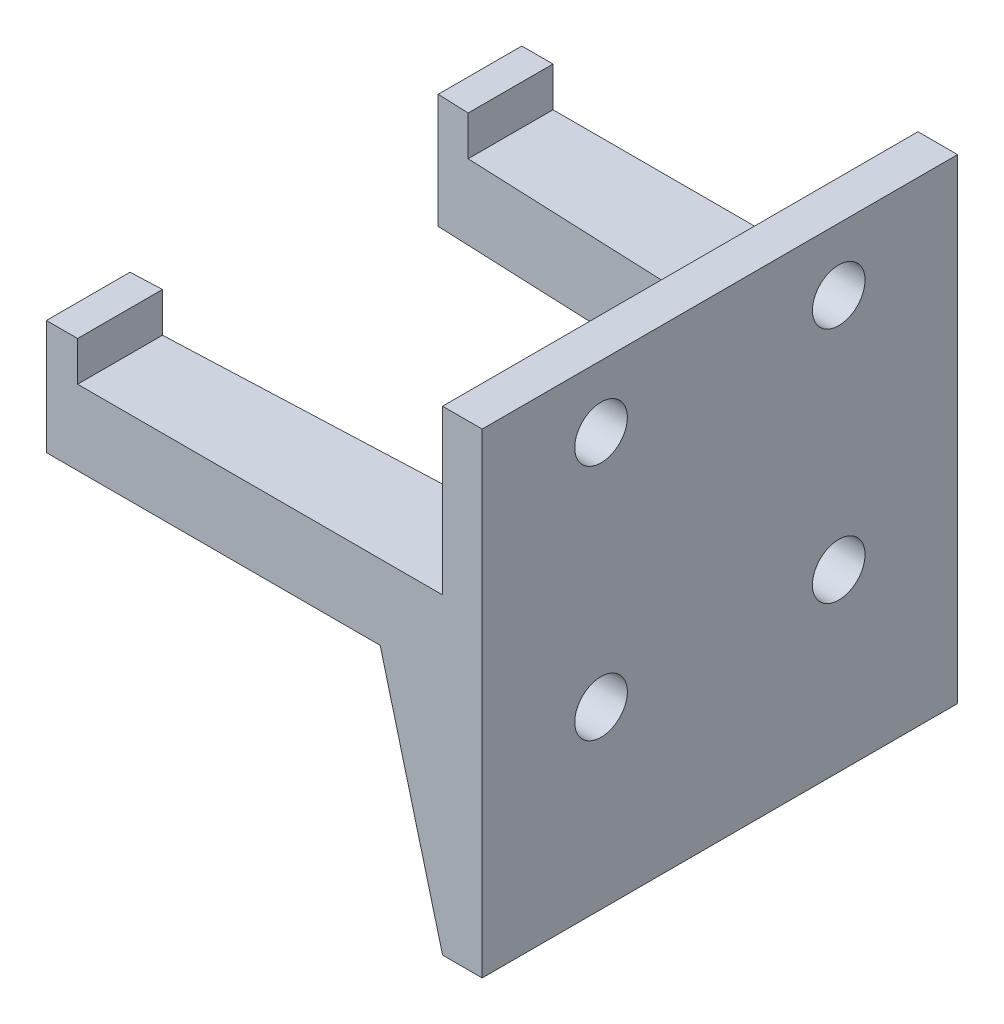
ISO-10303-21;
HEADER;
FILE_DESCRIPTION(('STEP AP214'),'2;1');
FILE_NAME('part.step','',(''),(''),'','','');
FILE_SCHEMA(('AUTOMOTIVE_DESIGN { 1 0 10303 214 1 1 1 1 }'));
ENDSEC;
DATA;
#1=APPLICATION_CONTEXT('core data for automotive mechanical design processes');
#2=APPLICATION_PROTOCOL_DEFINITION('international standard','automotive_design',2000,#1);
#3=PRODUCT_CONTEXT('',#1,'mechanical');
#4=PRODUCT('Part','Part','',(#3));
#5=PRODUCT_RELATED_PRODUCT_CATEGORY('part','',(#4));
#6=PRODUCT_DEFINITION_FORMATION('','',#4);
#7=PRODUCT_DEFINITION_CONTEXT('part definition',#1,'design');
#8=PRODUCT_DEFINITION('design','',#6,#7);
#9=PRODUCT_DEFINITION_SHAPE('','',#8);
#10=(LENGTH_UNIT() NAMED_UNIT(*) SI_UNIT(.MILLI.,.METRE.));
#11=(NAMED_UNIT(*) PLANE_ANGLE_UNIT() SI_UNIT($,.RADIAN.));
#12=(NAMED_UNIT(*) SI_UNIT($,.STERADIAN.) SOLID_ANGLE_UNIT());
#13=UNCERTAINTY_MEASURE_WITH_UNIT(LENGTH_MEASURE(1.E-05),#10,'distance_accuracy_value','');
#14=(GEOMETRIC_REPRESENTATION_CONTEXT(3) GLOBAL_UNCERTAINTY_ASSIGNED_CONTEXT((#13)) GLOBAL_UNIT_ASSIGNED_CONTEXT((#10,
#11,#12)) REPRESENTATION_CONTEXT('',''));
#15=CARTESIAN_POINT('',(0.,0.,0.));
#16=DIRECTION('',(0.,0.,1.));
#17=DIRECTION('',(1.,0.,0.));
#18=AXIS2_PLACEMENT_3D('',#15,#16,#17);
#19=CARTESIAN_POINT('',(-0.662920782901185,-162.189553807425,16.0015361389941));
#20=DIRECTION('',(0.0413930646498256,0.,-0.999142939823375));
#21=DIRECTION('',(-0.999142939823375,0.,-0.0413930646498256));
#22=AXIS2_PLACEMENT_3D('',#19,#20,#21);
#23=PLANE('',#22);
#24=DIRECTION('',(0.,1.,0.));
#25=VECTOR('',#24,1.);
#26=CARTESIAN_POINT('',(0.,-162.189553807425,16.029));
#27=LINE('',#26,#25);
#28=CARTESIAN_POINT('',(0.,-76.2,16.029));
#29=VERTEX_POINT('',#28);
#30=CARTESIAN_POINT('',(0.,-56.4609604113403,16.029));
#31=VERTEX_POINT('',#30);
#32=EDGE_CURVE('E244',#29,#31,#27,.T.);
#33=ORIENTED_EDGE('',*,*,#32,.T.);
#34=CARTESIAN_POINT('',(72.9206896551722,-48.1,19.05));
#35=DIRECTION('',(0.0413930646498256,0.,-0.999142939823375));
#36=DIRECTION('',(0.999142939823375,0.,0.0413930646498256));
#37=AXIS2_PLACEMENT_3D('',#34,#35,#36);
#38=ELLIPSE('',#37,214.770277948904,8.89);
#39=CARTESIAN_POINT('',(-5.21586934217731,-56.3796964997262,15.8129139843955));
#40=VERTEX_POINT('',#39);
#41=EDGE_CURVE('E365',#31,#40,#38,.T.);
#42=ORIENTED_EDGE('',*,*,#41,.T.);
#43=DIRECTION('',(-0.254479155588291,0.967020791235507,-0.0105427078743721));
#44=VECTOR('',#43,1.);
#45=CARTESIAN_POINT('',(-18.5903688008669,-5.55659855670586,15.2588275782498));
#46=LINE('',#45,#44);
#47=EDGE_CURVE('E169',#29,#40,#46,.T.);
#48=ORIENTED_EDGE('',*,*,#47,.F.);
#49=EDGE_LOOP('',(#33,#42,#48));
#50=FACE_BOUND('',#49,.T.);
#51=ADVANCED_FACE('F38',(#50),#23,.F.);
#52=CARTESIAN_POINT('',(-9.55451415992493,-39.8928461922853,15.6331701276603));
#53=VERTEX_POINT('',#52);
#54=CARTESIAN_POINT('',(-9.99999999999999,-38.2,15.6147142857143));
#55=VERTEX_POINT('',#54);
#56=EDGE_CURVE('E272',#53,#55,#46,.T.);
#57=ORIENTED_EDGE('',*,*,#56,.F.);
#58=CARTESIAN_POINT('',(72.9206896551722,-48.1,19.05));
#59=DIRECTION('',(0.0413930646498256,0.,-0.999142939823375));
#60=DIRECTION('',(0.999142939823375,0.,0.0413930646498256));
#61=AXIS2_PLACEMENT_3D('',#58,#59,#60);
#62=ELLIPSE('',#61,214.770277948904,8.89);
#63=CARTESIAN_POINT('',(0.,-39.7390395886597,16.029));
#64=VERTEX_POINT('',#63);
#65=EDGE_CURVE('E351',#53,#64,#62,.T.);
#66=ORIENTED_EDGE('',*,*,#65,.T.);
#67=CARTESIAN_POINT('',(0.,-26.2000000000001,16.029));
#68=VERTEX_POINT('',#67);
#69=EDGE_CURVE('E240',#64,#68,#27,.T.);
#70=ORIENTED_EDGE('',*,*,#69,.T.);
#71=DIRECTION('',(0.999142939823375,0.,0.0413930646498256));
#72=VECTOR('',#71,1.);
#73=CARTESIAN_POINT('',(2.48852744575128,-26.2,16.1320961370383));
#74=LINE('',#73,#72);
#75=CARTESIAN_POINT('',(-58.5,-26.2,13.6054285714286));
#76=VERTEX_POINT('',#75);
#77=EDGE_CURVE('E269',#76,#68,#74,.T.);
#78=ORIENTED_EDGE('',*,*,#77,.F.);
#79=DIRECTION('',(0.,1.,0.));
#80=VECTOR('',#79,1.);
#81=CARTESIAN_POINT('',(-58.5,0.,13.6054285714286));
#82=LINE('',#81,#80);
#83=CARTESIAN_POINT('',(-58.5,-19.85,13.6054285714286));
#84=VERTEX_POINT('',#83);
#85=EDGE_CURVE('E266',#76,#84,#82,.T.);
#86=ORIENTED_EDGE('',*,*,#85,.T.);
#87=DIRECTION('',(-0.999142939823375,0.,-0.0413930646498256));
#88=VECTOR('',#87,1.);
#89=CARTESIAN_POINT('',(2.48852744575127,-19.85,16.1320961370383));
#90=LINE('',#89,#88);
#91=CARTESIAN_POINT('',(-63.5,-19.85,13.3982857142857));
#92=VERTEX_POINT('',#91);
#93=EDGE_CURVE('E263',#84,#92,#90,.T.);
#94=ORIENTED_EDGE('',*,*,#93,.T.);
#95=DIRECTION('',(0.,1.,0.));
#96=VECTOR('',#95,1.);
#97=CARTESIAN_POINT('',(-63.5,0.,13.3982857142857));
#98=LINE('',#97,#96);
#99=CARTESIAN_POINT('',(-63.5,-38.2,13.3982857142857));
#100=VERTEX_POINT('',#99);
#101=EDGE_CURVE('E260',#100,#92,#98,.T.);
#102=ORIENTED_EDGE('',*,*,#101,.F.);
#103=DIRECTION('',(-0.999142939823375,0.,-0.0413930646498256));
#104=VECTOR('',#103,1.);
#105=CARTESIAN_POINT('',(2.48852744575127,-38.2,16.1320961370383));
#106=LINE('',#105,#104);
#107=EDGE_CURVE('E11',#55,#100,#106,.T.);
#108=ORIENTED_EDGE('',*,*,#107,.F.);
#109=EDGE_LOOP('',(#57,#66,#70,#78,#86,#94,#102,#108));
#110=FACE_BOUND('',#109,.T.);
#111=ADVANCED_FACE('F320',(#110),#23,.F.);
#112=CARTESIAN_POINT('',(2.48852744575127,-162.189553807425,60.0679038629617));
#113=DIRECTION('',(-0.0413930646498255,0.,-0.999142939823375));
#114=DIRECTION('',(-0.999142939823375,0.,0.0413930646498255));
#115=AXIS2_PLACEMENT_3D('',#112,#113,#114);
#116=PLANE('',#115);
#117=CARTESIAN_POINT('',(72.9206896551725,-48.1,57.15));
#118=DIRECTION('',(-0.0413930646498255,0.,-0.999142939823375));
#119=DIRECTION('',(0.999142939823375,0.,-0.0413930646498255));
#120=AXIS2_PLACEMENT_3D('',#117,#118,#119);
#121=ELLIPSE('',#120,214.770277948904,8.89);
#122=CARTESIAN_POINT('',(0.,-56.4609604113403,60.171));
#123=VERTEX_POINT('',#122);
#124=CARTESIAN_POINT('',(-5.21586934217731,-56.3796964997262,60.3870860156045));
#125=VERTEX_POINT('',#124);
#126=EDGE_CURVE('E363',#123,#125,#121,.T.);
#127=ORIENTED_EDGE('',*,*,#126,.F.);
#128=DIRECTION('',(0.,1.,0.));
#129=VECTOR('',#128,1.);
#130=CARTESIAN_POINT('',(0.,-162.189553807425,60.171));
#131=LINE('',#130,#129);
#132=CARTESIAN_POINT('',(0.,-76.2,60.171));
#133=VERTEX_POINT('',#132);
#134=EDGE_CURVE('E241',#133,#123,#131,.T.);
#135=ORIENTED_EDGE('',*,*,#134,.F.);
#136=DIRECTION('',(-0.254479155588291,0.967020791235507,0.0105427078743721));
#137=VECTOR('',#136,1.);
#138=CARTESIAN_POINT('',(-18.7948057349552,-4.77973820717032,60.9496419518767));
#139=LINE('',#138,#137);
#140=EDGE_CURVE('E257',#133,#125,#139,.T.);
#141=ORIENTED_EDGE('',*,*,#140,.T.);
#142=EDGE_LOOP('',(#127,#135,#141));
#143=FACE_BOUND('',#142,.T.);
#144=ADVANCED_FACE('F415',(#143),#116,.T.);
#145=CARTESIAN_POINT('',(72.9206896551725,-48.1,57.15));
#146=DIRECTION('',(-0.0413930646498255,0.,-0.999142939823375));
#147=DIRECTION('',(0.999142939823375,0.,-0.0413930646498255));
#148=AXIS2_PLACEMENT_3D('',#145,#146,#147);
#149=ELLIPSE('',#148,214.770277948904,8.89);
#150=CARTESIAN_POINT('',(-9.55451415992492,-39.8928461922853,60.5668298723397));
#151=VERTEX_POINT('',#150);
#152=CARTESIAN_POINT('',(0.,-39.7390395886597,60.171));
#153=VERTEX_POINT('',#152);
#154=EDGE_CURVE('E368',#151,#153,#149,.T.);
#155=ORIENTED_EDGE('',*,*,#154,.F.);
#156=CARTESIAN_POINT('',(-9.99999999999999,-38.2,60.5852857142857));
#157=VERTEX_POINT('',#156);
#158=EDGE_CURVE('E55',#151,#157,#139,.T.);
#159=ORIENTED_EDGE('',*,*,#158,.T.);
#160=DIRECTION('',(-0.999142939823375,0.,0.0413930646498255));
#161=VECTOR('',#160,1.);
#162=CARTESIAN_POINT('',(-0.662920782901184,-38.2,60.1984638610059));
#163=LINE('',#162,#161);
#164=CARTESIAN_POINT('',(-63.5,-38.2,62.8017142857143));
#165=VERTEX_POINT('',#164);
#166=EDGE_CURVE('E47',#157,#165,#163,.T.);
#167=ORIENTED_EDGE('',*,*,#166,.T.);
#168=DIRECTION('',(0.,1.,0.));
#169=VECTOR('',#168,1.);
#170=CARTESIAN_POINT('',(-63.5,0.,62.8017142857143));
#171=LINE('',#170,#169);
#172=CARTESIAN_POINT('',(-63.5,-19.85,62.8017142857143));
#173=VERTEX_POINT('',#172);
#174=EDGE_CURVE('E247',#165,#173,#171,.T.);
#175=ORIENTED_EDGE('',*,*,#174,.T.);
#176=DIRECTION('',(-0.999142939823375,0.,0.0413930646498255));
#177=VECTOR('',#176,1.);
#178=CARTESIAN_POINT('',(-0.662920782901184,-19.85,60.1984638610059));
#179=LINE('',#178,#177);
#180=CARTESIAN_POINT('',(-58.5,-19.85,62.5945714285714));
#181=VERTEX_POINT('',#180);
#182=EDGE_CURVE('E144',#181,#173,#179,.T.);
#183=ORIENTED_EDGE('',*,*,#182,.F.);
#184=DIRECTION('',(0.,1.,0.));
#185=VECTOR('',#184,1.);
#186=CARTESIAN_POINT('',(-58.5,0.,62.5945714285714));
#187=LINE('',#186,#185);
#188=CARTESIAN_POINT('',(-58.5,-26.2,62.5945714285714));
#189=VERTEX_POINT('',#188);
#190=EDGE_CURVE('E251',#189,#181,#187,.T.);
#191=ORIENTED_EDGE('',*,*,#190,.F.);
#192=DIRECTION('',(0.999142939823375,0.,-0.0413930646498255));
#193=VECTOR('',#192,1.);
#194=CARTESIAN_POINT('',(-0.662920782901183,-26.2,60.1984638610059));
#195=LINE('',#194,#193);
#196=CARTESIAN_POINT('',(0.,-26.2000000000001,60.171));
#197=VERTEX_POINT('',#196);
#198=EDGE_CURVE('E254',#189,#197,#195,.T.);
#199=ORIENTED_EDGE('',*,*,#198,.T.);
#200=EDGE_CURVE('E226',#153,#197,#131,.T.);
#201=ORIENTED_EDGE('',*,*,#200,.F.);
#202=EDGE_LOOP('',(#155,#159,#167,#175,#183,#191,#199,#201));
#203=FACE_BOUND('',#202,.T.);
#204=ADVANCED_FACE('F440',(#203),#116,.T.);
#205=CARTESIAN_POINT('',(-18.7538860103627,-4.93523316062176,76.2));
#206=DIRECTION('',(0.967074537262646,0.254493299279644,0.));
#207=DIRECTION('',(-0.254493299279644,0.967074537262646,0.));
#208=AXIS2_PLACEMENT_3D('',#205,#206,#207);
#209=PLANE('',#208);
#210=ORIENTED_EDGE('',*,*,#158,.F.);
#211=CARTESIAN_POINT('',(-7.39473684210526,-48.1,57.15));
#212=DIRECTION('',(0.967074537262646,0.254493299279644,0.));
#213=DIRECTION('',(0.254493299279644,-0.967074537262646,0.));
#214=AXIS2_PLACEMENT_3D('',#211,#212,#213);
#215=ELLIPSE('',#214,9.19267301273757,8.89);
#216=EDGE_CURVE('E421',#151,#125,#215,.T.);
#217=ORIENTED_EDGE('',*,*,#216,.T.);
#218=ORIENTED_EDGE('',*,*,#140,.F.);
#219=DIRECTION('',(0.,0.,-1.));
#220=VECTOR('',#219,1.);
#221=CARTESIAN_POINT('',(0.,-76.2,76.2));
#222=LINE('',#221,#220);
#223=CARTESIAN_POINT('',(0.,-76.2,76.2));
#224=VERTEX_POINT('',#223);
#225=EDGE_CURVE('E217',#224,#133,#222,.T.);
#226=ORIENTED_EDGE('',*,*,#225,.F.);
#227=DIRECTION('',(0.254493299279644,-0.967074537262646,0.));
#228=VECTOR('',#227,1.);
#229=CARTESIAN_POINT('',(-18.7538860103627,-4.93523316062176,76.2));
#230=LINE('',#229,#228);
#231=CARTESIAN_POINT('',(-9.99999999999999,-38.2,76.2));
#232=VERTEX_POINT('',#231);
#233=EDGE_CURVE('E110',#232,#224,#230,.T.);
#234=ORIENTED_EDGE('',*,*,#233,.F.);
#235=DIRECTION('',(0.,0.,-1.));
#236=VECTOR('',#235,1.);
#237=CARTESIAN_POINT('',(-9.99999999999999,-38.2,76.2));
#238=LINE('',#237,#236);
#239=EDGE_CURVE('E195',#232,#157,#238,.T.);
#240=ORIENTED_EDGE('',*,*,#239,.T.);
#241=EDGE_LOOP('',(#210,#217,#218,#226,#234,#240));
#242=FACE_BOUND('',#241,.T.);
#243=ADVANCED_FACE('F419',(#242),#209,.F.);
#244=CARTESIAN_POINT('',(0.,-26.2,76.2));
#245=DIRECTION('',(0.,-1.,0.));
#246=DIRECTION('',(1.,0.,0.));
#247=AXIS2_PLACEMENT_3D('',#244,#245,#246);
#248=PLANE('',#247);
#249=ORIENTED_EDGE('',*,*,#198,.F.);
#250=DIRECTION('',(0.,0.,-1.));
#251=VECTOR('',#250,1.);
#252=CARTESIAN_POINT('',(-58.5,-26.2,76.2));
#253=LINE('',#252,#251);
#254=CARTESIAN_POINT('',(-58.5,-26.2,76.2));
#255=VERTEX_POINT('',#254);
#256=EDGE_CURVE('E203',#255,#189,#253,.T.);
#257=ORIENTED_EDGE('',*,*,#256,.F.);
#258=DIRECTION('',(-1.,0.,0.));
#259=VECTOR('',#258,1.);
#260=CARTESIAN_POINT('',(0.,-26.2,76.2));
#261=LINE('',#260,#259);
#262=CARTESIAN_POINT('',(0.,-26.2,76.2));
#263=VERTEX_POINT('',#262);
#264=EDGE_CURVE('E161',#263,#255,#261,.T.);
#265=ORIENTED_EDGE('',*,*,#264,.F.);
#266=DIRECTION('',(0.,0.,-1.));
#267=VECTOR('',#266,1.);
#268=CARTESIAN_POINT('',(0.,-26.2,76.2));
#269=LINE('',#268,#267);
#270=EDGE_CURVE('E207',#263,#197,#269,.T.);
#271=ORIENTED_EDGE('',*,*,#270,.T.);
#272=EDGE_LOOP('',(#249,#257,#265,#271));
#273=FACE_BOUND('',#272,.T.);
#274=ADVANCED_FACE('F293',(#273),#248,.F.);
#275=CARTESIAN_POINT('',(-58.5,0.,76.2));
#276=DIRECTION('',(1.,0.,0.));
#277=DIRECTION('',(0.,0.,-1.));
#278=AXIS2_PLACEMENT_3D('',#275,#276,#277);
#279=PLANE('',#278);
#280=ORIENTED_EDGE('',*,*,#256,.T.);
#281=ORIENTED_EDGE('',*,*,#190,.T.);
#282=DIRECTION('',(0.,0.,-1.));
#283=VECTOR('',#282,1.);
#284=CARTESIAN_POINT('',(-58.5,-19.85,76.2));
#285=LINE('',#284,#283);
#286=CARTESIAN_POINT('',(-58.5,-19.85,76.2));
#287=VERTEX_POINT('',#286);
#288=EDGE_CURVE('E200',#287,#181,#285,.T.);
#289=ORIENTED_EDGE('',*,*,#288,.F.);
#290=DIRECTION('',(0.,-1.,0.));
#291=VECTOR('',#290,1.);
#292=CARTESIAN_POINT('',(-58.5,0.,76.2));
#293=LINE('',#292,#291);
#294=EDGE_CURVE('E159',#287,#255,#293,.T.);
#295=ORIENTED_EDGE('',*,*,#294,.T.);
#296=EDGE_LOOP('',(#280,#281,#289,#295));
#297=FACE_BOUND('',#296,.T.);
#298=ADVANCED_FACE('F296',(#297),#279,.T.);
#299=CARTESIAN_POINT('',(0.,-19.85,76.2));
#300=DIRECTION('',(0.,1.,0.));
#301=DIRECTION('',(0.,0.,1.));
#302=AXIS2_PLACEMENT_3D('',#299,#300,#301);
#303=PLANE('',#302);
#304=ORIENTED_EDGE('',*,*,#288,.T.);
#305=ORIENTED_EDGE('',*,*,#182,.T.);
#306=DIRECTION('',(0.,0.,-1.));
#307=VECTOR('',#306,1.);
#308=CARTESIAN_POINT('',(-63.5,-19.85,76.2));
#309=LINE('',#308,#307);
#310=CARTESIAN_POINT('',(-63.5,-19.85,76.2));
#311=VERTEX_POINT('',#310);
#312=EDGE_CURVE('E136',#311,#173,#309,.T.);
#313=ORIENTED_EDGE('',*,*,#312,.F.);
#314=DIRECTION('',(1.,0.,0.));
#315=VECTOR('',#314,1.);
#316=CARTESIAN_POINT('',(0.,-19.85,76.2));
#317=LINE('',#316,#315);
#318=EDGE_CURVE('E141',#311,#287,#317,.T.);
#319=ORIENTED_EDGE('',*,*,#318,.T.);
#320=EDGE_LOOP('',(#304,#305,#313,#319));
#321=FACE_BOUND('',#320,.T.);
#322=ADVANCED_FACE('F139',(#321),#303,.T.);
#323=CARTESIAN_POINT('',(-63.5,0.,76.2));
#324=DIRECTION('',(1.,0.,0.));
#325=DIRECTION('',(0.,1.,0.));
#326=AXIS2_PLACEMENT_3D('',#323,#324,#325);
#327=PLANE('',#326);
#328=ORIENTED_EDGE('',*,*,#174,.F.);
#329=DIRECTION('',(0.,0.,-1.));
#330=VECTOR('',#329,1.);
#331=CARTESIAN_POINT('',(-63.5,-38.2,76.2));
#332=LINE('',#331,#330);
#333=CARTESIAN_POINT('',(-63.5,-38.2,76.2));
#334=VERTEX_POINT('',#333);
#335=EDGE_CURVE('E154',#334,#165,#332,.T.);
#336=ORIENTED_EDGE('',*,*,#335,.F.);
#337=DIRECTION('',(0.,-1.,0.));
#338=VECTOR('',#337,1.);
#339=CARTESIAN_POINT('',(-63.5,0.,76.2));
#340=LINE('',#339,#338);
#341=EDGE_CURVE('E151',#311,#334,#340,.T.);
#342=ORIENTED_EDGE('',*,*,#341,.F.);
#343=ORIENTED_EDGE('',*,*,#312,.T.);
#344=EDGE_LOOP('',(#328,#336,#342,#343));
#345=FACE_BOUND('',#344,.T.);
#346=ADVANCED_FACE('F152',(#345),#327,.F.);
#347=CARTESIAN_POINT('',(0.,-38.2,76.2));
#348=DIRECTION('',(0.,1.,0.));
#349=DIRECTION('',(0.,0.,1.));
#350=AXIS2_PLACEMENT_3D('',#347,#348,#349);
#351=PLANE('',#350);
#352=ORIENTED_EDGE('',*,*,#166,.F.);
#353=ORIENTED_EDGE('',*,*,#239,.F.);
#354=DIRECTION('',(1.,0.,0.));
#355=VECTOR('',#354,1.);
#356=CARTESIAN_POINT('',(0.,-38.2,76.2));
#357=LINE('',#356,#355);
#358=EDGE_CURVE('E64',#334,#232,#357,.T.);
#359=ORIENTED_EDGE('',*,*,#358,.F.);
#360=ORIENTED_EDGE('',*,*,#335,.T.);
#361=EDGE_LOOP('',(#352,#353,#359,#360));
#362=FACE_BOUND('',#361,.T.);
#363=ADVANCED_FACE('F447',(#362),#351,.F.);
#364=ORIENTED_EDGE('',*,*,#47,.T.);
#365=CARTESIAN_POINT('',(-7.39473684210526,-48.1,19.05));
#366=DIRECTION('',(0.967074537262646,0.254493299279644,0.));
#367=DIRECTION('',(0.254493299279644,-0.967074537262646,0.));
#368=AXIS2_PLACEMENT_3D('',#365,#366,#367);
#369=ELLIPSE('',#368,9.19267301273757,8.89);
#370=EDGE_CURVE('E357',#40,#53,#369,.T.);
#371=ORIENTED_EDGE('',*,*,#370,.T.);
#372=ORIENTED_EDGE('',*,*,#56,.T.);
#373=CARTESIAN_POINT('',(-9.99999999999999,-38.2,0.));
#374=VERTEX_POINT('',#373);
#375=EDGE_CURVE('E104',#55,#374,#238,.T.);
#376=ORIENTED_EDGE('',*,*,#375,.T.);
#377=DIRECTION('',(0.254493299279644,-0.967074537262646,0.));
#378=VECTOR('',#377,1.);
#379=CARTESIAN_POINT('',(-18.7538860103627,-4.93523316062176,0.));
#380=LINE('',#379,#378);
#381=CARTESIAN_POINT('',(0.,-76.2,0.));
#382=VERTEX_POINT('',#381);
#383=EDGE_CURVE('E166',#374,#382,#380,.T.);
#384=ORIENTED_EDGE('',*,*,#383,.T.);
#385=EDGE_CURVE('E216',#29,#382,#222,.T.);
#386=ORIENTED_EDGE('',*,*,#385,.F.);
#387=EDGE_LOOP('',(#364,#371,#372,#376,#384,#386));
#388=FACE_BOUND('',#387,.T.);
#389=ADVANCED_FACE('F40',(#388),#209,.F.);
#390=CARTESIAN_POINT('',(0.,-76.2,76.2));
#391=DIRECTION('',(0.,-1.,0.));
#392=DIRECTION('',(0.,0.,-1.));
#393=AXIS2_PLACEMENT_3D('',#390,#391,#392);
#394=PLANE('',#393);
#395=DIRECTION('',(-1.,0.,0.));
#396=VECTOR('',#395,1.);
#397=CARTESIAN_POINT('',(0.,-76.2,0.));
#398=LINE('',#397,#396);
#399=CARTESIAN_POINT('',(6.35000000000001,-76.2,0.));
#400=VERTEX_POINT('',#399);
#401=EDGE_CURVE('E168',#400,#382,#398,.T.);
#402=ORIENTED_EDGE('',*,*,#401,.F.);
#403=DIRECTION('',(0.,0.,-1.));
#404=VECTOR('',#403,1.);
#405=CARTESIAN_POINT('',(6.35000000000001,-76.2,76.2));
#406=LINE('',#405,#404);
#407=CARTESIAN_POINT('',(6.35000000000001,-76.2,76.2));
#408=VERTEX_POINT('',#407);
#409=EDGE_CURVE('E214',#408,#400,#406,.T.);
#410=ORIENTED_EDGE('',*,*,#409,.F.);
#411=DIRECTION('',(-1.,0.,0.));
#412=VECTOR('',#411,1.);
#413=CARTESIAN_POINT('',(0.,-76.2,76.2));
#414=LINE('',#413,#412);
#415=EDGE_CURVE('E276',#408,#224,#414,.T.);
#416=ORIENTED_EDGE('',*,*,#415,.T.);
#417=ORIENTED_EDGE('',*,*,#225,.T.);
#418=DIRECTION('',(0.,0.,-1.));
#419=VECTOR('',#418,1.);
#420=CARTESIAN_POINT('',(0.,-76.2,0.));
#421=LINE('',#420,#419);
#422=EDGE_CURVE('E237',#133,#29,#421,.T.);
#423=ORIENTED_EDGE('',*,*,#422,.T.);
#424=ORIENTED_EDGE('',*,*,#385,.T.);
#425=EDGE_LOOP('',(#402,#410,#416,#417,#423,#424));
#426=FACE_BOUND('',#425,.T.);
#427=ADVANCED_FACE('F390',(#426),#394,.T.);
#428=CARTESIAN_POINT('',(6.35,0.,76.2));
#429=DIRECTION('',(1.,0.,0.));
#430=DIRECTION('',(0.,1.,0.));
#431=AXIS2_PLACEMENT_3D('',#428,#429,#430);
#432=PLANE('',#431);
#433=CARTESIAN_POINT('',(6.35,-48.1,19.05));
#434=DIRECTION('',(1.,0.,0.));
#435=DIRECTION('',(0.,1.,0.));
#436=AXIS2_PLACEMENT_3D('',#433,#434,#435);
#437=CIRCLE('',#436,4.2164);
#438=CARTESIAN_POINT('',(6.35,-43.8836,19.05));
#439=VERTEX_POINT('',#438);
#440=EDGE_CURVE('E373',#439,#439,#437,.T.);
#441=ORIENTED_EDGE('',*,*,#440,.F.);
#442=EDGE_LOOP('',(#441));
#443=FACE_BOUND('',#442,.T.);
#444=CARTESIAN_POINT('',(6.35,-48.1,57.15));
#445=DIRECTION('',(1.,0.,0.));
#446=DIRECTION('',(0.,1.,0.));
#447=AXIS2_PLACEMENT_3D('',#444,#445,#446);
#448=CIRCLE('',#447,4.2164);
#449=CARTESIAN_POINT('',(6.35,-43.8836,57.15));
#450=VERTEX_POINT('',#449);
#451=EDGE_CURVE('E377',#450,#450,#448,.T.);
#452=ORIENTED_EDGE('',*,*,#451,.F.);
#453=EDGE_LOOP('',(#452));
#454=FACE_BOUND('',#453,.T.);
#455=CARTESIAN_POINT('',(6.35,-10.,57.15));
#456=DIRECTION('',(1.,0.,0.));
#457=DIRECTION('',(0.,1.,0.));
#458=AXIS2_PLACEMENT_3D('',#455,#456,#457);
#459=CIRCLE('',#458,4.2164);
#460=CARTESIAN_POINT('',(6.35,-5.7836,57.15));
#461=VERTEX_POINT('',#460);
#462=EDGE_CURVE('E374',#461,#461,#459,.T.);
#463=ORIENTED_EDGE('',*,*,#462,.F.);
#464=EDGE_LOOP('',(#463));
#465=FACE_BOUND('',#464,.T.);
#466=CARTESIAN_POINT('',(6.35,-10.,19.05));
#467=DIRECTION('',(1.,0.,0.));
#468=DIRECTION('',(0.,1.,0.));
#469=AXIS2_PLACEMENT_3D('',#466,#467,#468);
#470=CIRCLE('',#469,4.2164);
#471=CARTESIAN_POINT('',(6.35,-5.7836,19.05));
#472=VERTEX_POINT('',#471);
#473=EDGE_CURVE('E233',#472,#472,#470,.T.);
#474=ORIENTED_EDGE('',*,*,#473,.F.);
#475=EDGE_LOOP('',(#474));
#476=FACE_BOUND('',#475,.T.);
#477=DIRECTION('',(0.,-1.,0.));
#478=VECTOR('',#477,1.);
#479=CARTESIAN_POINT('',(6.35,0.,0.));
#480=LINE('',#479,#478);
#481=CARTESIAN_POINT('',(6.35,0.,0.));
#482=VERTEX_POINT('',#481);
#483=EDGE_CURVE('E172',#482,#400,#480,.T.);
#484=ORIENTED_EDGE('',*,*,#483,.F.);
#485=DIRECTION('',(0.,0.,-1.));
#486=VECTOR('',#485,1.);
#487=CARTESIAN_POINT('',(6.35,0.,76.2));
#488=LINE('',#487,#486);
#489=CARTESIAN_POINT('',(6.35,0.,76.2));
#490=VERTEX_POINT('',#489);
#491=EDGE_CURVE('E212',#490,#482,#488,.T.);
#492=ORIENTED_EDGE('',*,*,#491,.F.);
#493=DIRECTION('',(0.,-1.,0.));
#494=VECTOR('',#493,1.);
#495=CARTESIAN_POINT('',(6.35,0.,76.2));
#496=LINE('',#495,#494);
#497=EDGE_CURVE('E279',#490,#408,#496,.T.);
#498=ORIENTED_EDGE('',*,*,#497,.T.);
#499=ORIENTED_EDGE('',*,*,#409,.T.);
#500=EDGE_LOOP('',(#484,#492,#498,#499));
#501=FACE_BOUND('',#500,.T.);
#502=ADVANCED_FACE('F386',(#443,#454,#465,#476,#501),#432,.T.);
#503=CARTESIAN_POINT('',(0.,0.,76.2));
#504=DIRECTION('',(0.,1.,0.));
#505=DIRECTION('',(0.,0.,1.));
#506=AXIS2_PLACEMENT_3D('',#503,#504,#505);
#507=PLANE('',#506);
#508=DIRECTION('',(1.,0.,0.));
#509=VECTOR('',#508,1.);
#510=CARTESIAN_POINT('',(0.,0.,0.));
#511=LINE('',#510,#509);
#512=CARTESIAN_POINT('',(0.,0.,0.));
#513=VERTEX_POINT('',#512);
#514=EDGE_CURVE('E175',#513,#482,#511,.T.);
#515=ORIENTED_EDGE('',*,*,#514,.F.);
#516=DIRECTION('',(0.,0.,-1.));
#517=VECTOR('',#516,1.);
#518=CARTESIAN_POINT('',(0.,0.,76.2));
#519=LINE('',#518,#517);
#520=CARTESIAN_POINT('',(0.,0.,76.2));
#521=VERTEX_POINT('',#520);
#522=EDGE_CURVE('E210',#521,#513,#519,.T.);
#523=ORIENTED_EDGE('',*,*,#522,.F.);
#524=DIRECTION('',(1.,0.,0.));
#525=VECTOR('',#524,1.);
#526=CARTESIAN_POINT('',(0.,0.,76.2));
#527=LINE('',#526,#525);
#528=EDGE_CURVE('E282',#521,#490,#527,.T.);
#529=ORIENTED_EDGE('',*,*,#528,.T.);
#530=ORIENTED_EDGE('',*,*,#491,.T.);
#531=EDGE_LOOP('',(#515,#523,#529,#530));
#532=FACE_BOUND('',#531,.T.);
#533=ADVANCED_FACE('F389',(#532),#507,.T.);
#534=CARTESIAN_POINT('',(0.,0.,76.2));
#535=DIRECTION('',(1.,0.,0.));
#536=DIRECTION('',(0.,1.,0.));
#537=AXIS2_PLACEMENT_3D('',#534,#535,#536);
#538=PLANE('',#537);
#539=CARTESIAN_POINT('',(0.,-48.1,19.05));
#540=DIRECTION('',(1.,0.,0.));
#541=DIRECTION('',(0.,0.,-1.));
#542=AXIS2_PLACEMENT_3D('',#539,#540,#541);
#543=CIRCLE('',#542,8.89);
#544=EDGE_CURVE('E426',#31,#64,#543,.T.);
#545=ORIENTED_EDGE('',*,*,#544,.F.);
#546=ORIENTED_EDGE('',*,*,#32,.F.);
#547=ORIENTED_EDGE('',*,*,#422,.F.);
#548=ORIENTED_EDGE('',*,*,#134,.T.);
#549=CARTESIAN_POINT('',(0.,-48.1,57.15));
#550=DIRECTION('',(1.,0.,0.));
#551=DIRECTION('',(0.,0.,-1.));
#552=AXIS2_PLACEMENT_3D('',#549,#550,#551);
#553=CIRCLE('',#552,8.89);
#554=EDGE_CURVE('E429',#153,#123,#553,.T.);
#555=ORIENTED_EDGE('',*,*,#554,.F.);
#556=ORIENTED_EDGE('',*,*,#200,.T.);
#557=ORIENTED_EDGE('',*,*,#270,.F.);
#558=DIRECTION('',(0.,-1.,0.));
#559=VECTOR('',#558,1.);
#560=CARTESIAN_POINT('',(0.,0.,76.2));
#561=LINE('',#560,#559);
#562=EDGE_CURVE('E285',#521,#263,#561,.T.);
#563=ORIENTED_EDGE('',*,*,#562,.F.);
#564=ORIENTED_EDGE('',*,*,#522,.T.);
#565=DIRECTION('',(0.,-1.,0.));
#566=VECTOR('',#565,1.);
#567=CARTESIAN_POINT('',(0.,0.,0.));
#568=LINE('',#567,#566);
#569=CARTESIAN_POINT('',(0.,-26.2,0.));
#570=VERTEX_POINT('',#569);
#571=EDGE_CURVE('E178',#513,#570,#568,.T.);
#572=ORIENTED_EDGE('',*,*,#571,.T.);
#573=EDGE_CURVE('E206',#68,#570,#269,.T.);
#574=ORIENTED_EDGE('',*,*,#573,.F.);
#575=ORIENTED_EDGE('',*,*,#69,.F.);
#576=EDGE_LOOP('',(#545,#546,#547,#548,#555,#556,#557,#563,#564,#572,#574,#575));
#577=FACE_BOUND('',#576,.T.);
#578=CARTESIAN_POINT('',(0.,-48.1,19.05));
#579=DIRECTION('',(1.,0.,0.));
#580=DIRECTION('',(0.,1.,0.));
#581=AXIS2_PLACEMENT_3D('',#578,#579,#580);
#582=CIRCLE('',#581,4.2164);
#583=CARTESIAN_POINT('',(0.,-43.8836,19.05));
#584=VERTEX_POINT('',#583);
#585=EDGE_CURVE('E222',#584,#584,#582,.F.);
#586=ORIENTED_EDGE('',*,*,#585,.F.);
#587=EDGE_LOOP('',(#586));
#588=FACE_BOUND('',#587,.T.);
#589=CARTESIAN_POINT('',(0.,-48.1,57.15));
#590=DIRECTION('',(1.,0.,0.));
#591=DIRECTION('',(0.,1.,0.));
#592=AXIS2_PLACEMENT_3D('',#589,#590,#591);
#593=CIRCLE('',#592,4.2164);
#594=CARTESIAN_POINT('',(0.,-43.8836,57.15));
#595=VERTEX_POINT('',#594);
#596=EDGE_CURVE('E228',#595,#595,#593,.F.);
#597=ORIENTED_EDGE('',*,*,#596,.F.);
#598=EDGE_LOOP('',(#597));
#599=FACE_BOUND('',#598,.T.);
#600=CARTESIAN_POINT('',(0.,-10.,57.15));
#601=DIRECTION('',(1.,0.,0.));
#602=DIRECTION('',(0.,1.,0.));
#603=AXIS2_PLACEMENT_3D('',#600,#601,#602);
#604=CIRCLE('',#603,4.2164);
#605=CARTESIAN_POINT('',(0.,-5.7836,57.15));
#606=VERTEX_POINT('',#605);
#607=EDGE_CURVE('E42',#606,#606,#604,.F.);
#608=ORIENTED_EDGE('',*,*,#607,.F.);
#609=EDGE_LOOP('',(#608));
#610=FACE_BOUND('',#609,.T.);
#611=CARTESIAN_POINT('',(0.,-10.,19.05));
#612=DIRECTION('',(1.,0.,0.));
#613=DIRECTION('',(0.,1.,0.));
#614=AXIS2_PLACEMENT_3D('',#611,#612,#613);
#615=CIRCLE('',#614,4.2164);
#616=CARTESIAN_POINT('',(0.,-5.7836,19.05));
#617=VERTEX_POINT('',#616);
#618=EDGE_CURVE('E220',#617,#617,#615,.F.);
#619=ORIENTED_EDGE('',*,*,#618,.F.);
#620=EDGE_LOOP('',(#619));
#621=FACE_BOUND('',#620,.T.);
#622=ADVANCED_FACE('F407',(#577,#588,#599,#610,#621),#538,.F.);
#623=CARTESIAN_POINT('',(-58.5,-26.2,0.));
#624=VERTEX_POINT('',#623);
#625=EDGE_CURVE('E202',#76,#624,#253,.T.);
#626=ORIENTED_EDGE('',*,*,#625,.F.);
#627=ORIENTED_EDGE('',*,*,#77,.T.);
#628=ORIENTED_EDGE('',*,*,#573,.T.);
#629=DIRECTION('',(-1.,0.,0.));
#630=VECTOR('',#629,1.);
#631=CARTESIAN_POINT('',(0.,-26.2,0.));
#632=LINE('',#631,#630);
#633=EDGE_CURVE('E181',#570,#624,#632,.T.);
#634=ORIENTED_EDGE('',*,*,#633,.T.);
#635=EDGE_LOOP('',(#626,#627,#628,#634));
#636=FACE_BOUND('',#635,.T.);
#637=ADVANCED_FACE('F330',(#636),#248,.F.);
#638=ORIENTED_EDGE('',*,*,#85,.F.);
#639=ORIENTED_EDGE('',*,*,#625,.T.);
#640=DIRECTION('',(0.,-1.,0.));
#641=VECTOR('',#640,1.);
#642=CARTESIAN_POINT('',(-58.5,0.,0.));
#643=LINE('',#642,#641);
#644=CARTESIAN_POINT('',(-58.5,-19.85,0.));
#645=VERTEX_POINT('',#644);
#646=EDGE_CURVE('E184',#645,#624,#643,.T.);
#647=ORIENTED_EDGE('',*,*,#646,.F.);
#648=EDGE_CURVE('E147',#84,#645,#285,.T.);
#649=ORIENTED_EDGE('',*,*,#648,.F.);
#650=EDGE_LOOP('',(#638,#639,#647,#649));
#651=FACE_BOUND('',#650,.T.);
#652=ADVANCED_FACE('F328',(#651),#279,.T.);
#653=ORIENTED_EDGE('',*,*,#93,.F.);
#654=ORIENTED_EDGE('',*,*,#648,.T.);
#655=DIRECTION('',(1.,0.,0.));
#656=VECTOR('',#655,1.);
#657=CARTESIAN_POINT('',(0.,-19.85,0.));
#658=LINE('',#657,#656);
#659=CARTESIAN_POINT('',(-63.5,-19.85,0.));
#660=VERTEX_POINT('',#659);
#661=EDGE_CURVE('E187',#660,#645,#658,.T.);
#662=ORIENTED_EDGE('',*,*,#661,.F.);
#663=EDGE_CURVE('E148',#92,#660,#309,.T.);
#664=ORIENTED_EDGE('',*,*,#663,.F.);
#665=EDGE_LOOP('',(#653,#654,#662,#664));
#666=FACE_BOUND('',#665,.T.);
#667=ADVANCED_FACE('F341',(#666),#303,.T.);
#668=CARTESIAN_POINT('',(-63.5,-38.2,0.));
#669=VERTEX_POINT('',#668);
#670=EDGE_CURVE('E198',#100,#669,#332,.T.);
#671=ORIENTED_EDGE('',*,*,#670,.F.);
#672=ORIENTED_EDGE('',*,*,#101,.T.);
#673=ORIENTED_EDGE('',*,*,#663,.T.);
#674=DIRECTION('',(0.,-1.,0.));
#675=VECTOR('',#674,1.);
#676=CARTESIAN_POINT('',(-63.5,0.,0.));
#677=LINE('',#676,#675);
#678=EDGE_CURVE('E190',#660,#669,#677,.T.);
#679=ORIENTED_EDGE('',*,*,#678,.T.);
#680=EDGE_LOOP('',(#671,#672,#673,#679));
#681=FACE_BOUND('',#680,.T.);
#682=ADVANCED_FACE('F345',(#681),#327,.F.);
#683=ORIENTED_EDGE('',*,*,#375,.F.);
#684=ORIENTED_EDGE('',*,*,#107,.T.);
#685=ORIENTED_EDGE('',*,*,#670,.T.);
#686=DIRECTION('',(1.,0.,0.));
#687=VECTOR('',#686,1.);
#688=CARTESIAN_POINT('',(0.,-38.2,0.));
#689=LINE('',#688,#687);
#690=EDGE_CURVE('E193',#669,#374,#689,.T.);
#691=ORIENTED_EDGE('',*,*,#690,.T.);
#692=EDGE_LOOP('',(#683,#684,#685,#691));
#693=FACE_BOUND('',#692,.T.);
#694=ADVANCED_FACE('F347',(#693),#351,.F.);
#695=CARTESIAN_POINT('',(0.,0.,76.2));
#696=DIRECTION('',(0.,0.,1.));
#697=DIRECTION('',(1.,0.,0.));
#698=AXIS2_PLACEMENT_3D('',#695,#696,#697);
#699=PLANE('',#698);
#700=ORIENTED_EDGE('',*,*,#233,.T.);
#701=ORIENTED_EDGE('',*,*,#415,.F.);
#702=ORIENTED_EDGE('',*,*,#497,.F.);
#703=ORIENTED_EDGE('',*,*,#528,.F.);
#704=ORIENTED_EDGE('',*,*,#562,.T.);
#705=ORIENTED_EDGE('',*,*,#264,.T.);
#706=ORIENTED_EDGE('',*,*,#294,.F.);
#707=ORIENTED_EDGE('',*,*,#318,.F.);
#708=ORIENTED_EDGE('',*,*,#341,.T.);
#709=ORIENTED_EDGE('',*,*,#358,.T.);
#710=EDGE_LOOP('',(#700,#701,#702,#703,#704,#705,#706,#707,#708,#709));
#711=FACE_BOUND('',#710,.T.);
#712=ADVANCED_FACE('F157',(#711),#699,.T.);
#713=CARTESIAN_POINT('',(0.,0.,0.));
#714=DIRECTION('',(0.,0.,1.));
#715=DIRECTION('',(1.,0.,0.));
#716=AXIS2_PLACEMENT_3D('',#713,#714,#715);
#717=PLANE('',#716);
#718=ORIENTED_EDGE('',*,*,#383,.F.);
#719=ORIENTED_EDGE('',*,*,#690,.F.);
#720=ORIENTED_EDGE('',*,*,#678,.F.);
#721=ORIENTED_EDGE('',*,*,#661,.T.);
#722=ORIENTED_EDGE('',*,*,#646,.T.);
#723=ORIENTED_EDGE('',*,*,#633,.F.);
#724=ORIENTED_EDGE('',*,*,#571,.F.);
#725=ORIENTED_EDGE('',*,*,#514,.T.);
#726=ORIENTED_EDGE('',*,*,#483,.T.);
#727=ORIENTED_EDGE('',*,*,#401,.T.);
#728=EDGE_LOOP('',(#718,#719,#720,#721,#722,#723,#724,#725,#726,#727));
#729=FACE_BOUND('',#728,.T.);
#730=ADVANCED_FACE('F335',(#729),#717,.F.);
#731=CARTESIAN_POINT('',(18.2757801287798,-48.1,57.15));
#732=DIRECTION('',(-1.,0.,0.));
#733=DIRECTION('',(0.,0.,1.));
#734=AXIS2_PLACEMENT_3D('',#731,#732,#733);
#735=CYLINDRICAL_SURFACE('',#734,4.2164);
#736=ORIENTED_EDGE('',*,*,#596,.T.);
#737=EDGE_LOOP('',(#736));
#738=FACE_BOUND('',#737,.T.);
#739=ORIENTED_EDGE('',*,*,#451,.T.);
#740=EDGE_LOOP('',(#739));
#741=FACE_BOUND('',#740,.T.);
#742=ADVANCED_FACE('F468',(#738,#741),#735,.F.);
#743=CARTESIAN_POINT('',(18.2757801287798,-48.1,19.05));
#744=DIRECTION('',(-1.,0.,0.));
#745=DIRECTION('',(0.,0.,1.));
#746=AXIS2_PLACEMENT_3D('',#743,#744,#745);
#747=CYLINDRICAL_SURFACE('',#746,4.2164);
#748=ORIENTED_EDGE('',*,*,#585,.T.);
#749=EDGE_LOOP('',(#748));
#750=FACE_BOUND('',#749,.T.);
#751=ORIENTED_EDGE('',*,*,#440,.T.);
#752=EDGE_LOOP('',(#751));
#753=FACE_BOUND('',#752,.T.);
#754=ADVANCED_FACE('F472',(#750,#753),#747,.F.);
#755=CARTESIAN_POINT('',(18.2757801287798,-10.,19.05));
#756=DIRECTION('',(-1.,0.,0.));
#757=DIRECTION('',(0.,0.,1.));
#758=AXIS2_PLACEMENT_3D('',#755,#756,#757);
#759=CYLINDRICAL_SURFACE('',#758,4.2164);
#760=ORIENTED_EDGE('',*,*,#473,.T.);
#761=EDGE_LOOP('',(#760));
#762=FACE_BOUND('',#761,.T.);
#763=ORIENTED_EDGE('',*,*,#618,.T.);
#764=EDGE_LOOP('',(#763));
#765=FACE_BOUND('',#764,.T.);
#766=ADVANCED_FACE('F384',(#762,#765),#759,.F.);
#767=CARTESIAN_POINT('',(18.2757801287798,-10.,57.15));
#768=DIRECTION('',(-1.,0.,0.));
#769=DIRECTION('',(0.,0.,1.));
#770=AXIS2_PLACEMENT_3D('',#767,#768,#769);
#771=CYLINDRICAL_SURFACE('',#770,4.2164);
#772=ORIENTED_EDGE('',*,*,#462,.T.);
#773=EDGE_LOOP('',(#772));
#774=FACE_BOUND('',#773,.T.);
#775=ORIENTED_EDGE('',*,*,#607,.T.);
#776=EDGE_LOOP('',(#775));
#777=FACE_BOUND('',#776,.T.);
#778=ADVANCED_FACE('F481',(#774,#777),#771,.F.);
#779=CARTESIAN_POINT('',(-10.,-48.1,19.05));
#780=DIRECTION('',(1.,0.,0.));
#781=DIRECTION('',(0.,0.,-1.));
#782=AXIS2_PLACEMENT_3D('',#779,#780,#781);
#783=CYLINDRICAL_SURFACE('',#782,8.89);
#784=ORIENTED_EDGE('',*,*,#544,.T.);
#785=ORIENTED_EDGE('',*,*,#65,.F.);
#786=ORIENTED_EDGE('',*,*,#370,.F.);
#787=ORIENTED_EDGE('',*,*,#41,.F.);
#788=EDGE_LOOP('',(#784,#785,#786,#787));
#789=FACE_BOUND('',#788,.T.);
#790=ADVANCED_FACE('F487',(#789),#783,.F.);
#791=CARTESIAN_POINT('',(-10.,-48.1,57.15));
#792=DIRECTION('',(1.,0.,0.));
#793=DIRECTION('',(0.,0.,-1.));
#794=AXIS2_PLACEMENT_3D('',#791,#792,#793);
#795=CYLINDRICAL_SURFACE('',#794,8.89);
#796=ORIENTED_EDGE('',*,*,#126,.T.);
#797=ORIENTED_EDGE('',*,*,#216,.F.);
#798=ORIENTED_EDGE('',*,*,#154,.T.);
#799=ORIENTED_EDGE('',*,*,#554,.T.);
#800=EDGE_LOOP('',(#796,#797,#798,#799));
#801=FACE_BOUND('',#800,.T.);
#802=ADVANCED_FACE('F433',(#801),#795,.F.);
#803=CLOSED_SHELL('',(#51,#111,#144,#204,#243,#274,#298,#322,#346,#363,#389,#427,#502,#533,#622,
#637,#652,#667,#682,#694,#712,#730,#742,#754,#766,#778,#790,#802));
#804=MANIFOLD_SOLID_BREP('B2',#803);
#805=ADVANCED_BREP_SHAPE_REPRESENTATION('',(#18,#804),#14);
#806=SHAPE_DEFINITION_REPRESENTATION(#9,#805);
ENDSEC;
END-ISO-10303-21;
